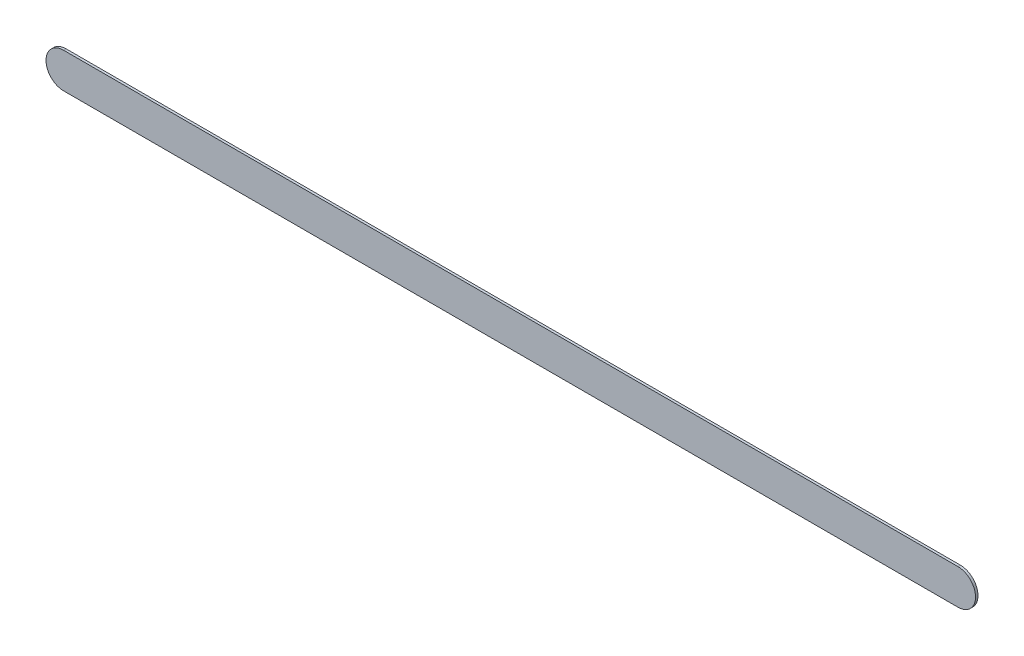
ISO-10303-21;
HEADER;
FILE_DESCRIPTION(('STEP AP214'),'2;1');
FILE_NAME('part.step','',(''),(''),'','','');
FILE_SCHEMA(('AUTOMOTIVE_DESIGN { 1 0 10303 214 1 1 1 1 }'));
ENDSEC;
DATA;
#1=APPLICATION_CONTEXT('core data for automotive mechanical design processes');
#2=APPLICATION_PROTOCOL_DEFINITION('international standard','automotive_design',2000,#1);
#3=PRODUCT_CONTEXT('',#1,'mechanical');
#4=PRODUCT('Part','Part','',(#3));
#5=PRODUCT_RELATED_PRODUCT_CATEGORY('part','',(#4));
#6=PRODUCT_DEFINITION_FORMATION('','',#4);
#7=PRODUCT_DEFINITION_CONTEXT('part definition',#1,'design');
#8=PRODUCT_DEFINITION('design','',#6,#7);
#9=PRODUCT_DEFINITION_SHAPE('','',#8);
#10=(LENGTH_UNIT() NAMED_UNIT(*) SI_UNIT(.MILLI.,.METRE.));
#11=(NAMED_UNIT(*) PLANE_ANGLE_UNIT() SI_UNIT($,.RADIAN.));
#12=(NAMED_UNIT(*) SI_UNIT($,.STERADIAN.) SOLID_ANGLE_UNIT());
#13=UNCERTAINTY_MEASURE_WITH_UNIT(LENGTH_MEASURE(1.E-05),#10,'distance_accuracy_value','');
#14=(GEOMETRIC_REPRESENTATION_CONTEXT(3) GLOBAL_UNCERTAINTY_ASSIGNED_CONTEXT((#13)) GLOBAL_UNIT_ASSIGNED_CONTEXT((#10,
#11,#12)) REPRESENTATION_CONTEXT('',''));
#15=CARTESIAN_POINT('',(0.,0.,0.));
#16=DIRECTION('',(0.,0.,1.));
#17=DIRECTION('',(1.,0.,0.));
#18=AXIS2_PLACEMENT_3D('',#15,#16,#17);
#19=CARTESIAN_POINT('',(160.528,-88.642,0.));
#20=DIRECTION('',(0.,0.,1.));
#21=DIRECTION('',(1.,0.,0.));
#22=AXIS2_PLACEMENT_3D('',#19,#20,#21);
#23=PLANE('',#22);
#24=DIRECTION('',(1.,0.,0.));
#25=VECTOR('',#24,1.);
#26=CARTESIAN_POINT('',(160.528,-88.642,0.));
#27=LINE('',#26,#25);
#28=CARTESIAN_POINT('',(160.528,-88.642,0.));
#29=VERTEX_POINT('',#28);
#30=CARTESIAN_POINT('',(173.228,-88.642,0.));
#31=VERTEX_POINT('',#30);
#32=EDGE_CURVE('E77',#29,#31,#27,.T.);
#33=ORIENTED_EDGE('',*,*,#32,.T.);
#34=CARTESIAN_POINT('',(173.228,-88.392,0.));
#35=DIRECTION('',(0.,0.,1.));
#36=DIRECTION('',(0.,-1.,0.));
#37=AXIS2_PLACEMENT_3D('',#34,#35,#36);
#38=CIRCLE('',#37,0.25);
#39=CARTESIAN_POINT('',(173.228,-88.142,0.));
#40=VERTEX_POINT('',#39);
#41=EDGE_CURVE('E75',#31,#40,#38,.T.);
#42=ORIENTED_EDGE('',*,*,#41,.T.);
#43=DIRECTION('',(-1.,0.,0.));
#44=VECTOR('',#43,1.);
#45=CARTESIAN_POINT('',(173.228,-88.142,0.));
#46=LINE('',#45,#44);
#47=CARTESIAN_POINT('',(160.528,-88.142,0.));
#48=VERTEX_POINT('',#47);
#49=EDGE_CURVE('E20',#40,#48,#46,.T.);
#50=ORIENTED_EDGE('',*,*,#49,.T.);
#51=CARTESIAN_POINT('',(160.528,-88.392,0.));
#52=DIRECTION('',(0.,0.,1.));
#53=DIRECTION('',(0.,1.,0.));
#54=AXIS2_PLACEMENT_3D('',#51,#52,#53);
#55=CIRCLE('',#54,0.25);
#56=EDGE_CURVE('E11',#48,#29,#55,.T.);
#57=ORIENTED_EDGE('',*,*,#56,.T.);
#58=EDGE_LOOP('',(#33,#42,#50,#57));
#59=FACE_BOUND('',#58,.T.);
#60=ADVANCED_FACE('F17',(#59),#23,.T.);
#61=CARTESIAN_POINT('',(160.528,-88.642,-0.035));
#62=DIRECTION('',(0.,0.,1.));
#63=DIRECTION('',(1.,0.,0.));
#64=AXIS2_PLACEMENT_3D('',#61,#62,#63);
#65=PLANE('',#64);
#66=CARTESIAN_POINT('',(160.528,-88.392,-0.035));
#67=DIRECTION('',(0.,0.,1.));
#68=DIRECTION('',(0.,1.,0.));
#69=AXIS2_PLACEMENT_3D('',#66,#67,#68);
#70=CIRCLE('',#69,0.25);
#71=CARTESIAN_POINT('',(160.528,-88.142,-0.035));
#72=VERTEX_POINT('',#71);
#73=CARTESIAN_POINT('',(160.528,-88.642,-0.035));
#74=VERTEX_POINT('',#73);
#75=EDGE_CURVE('E27',#72,#74,#70,.T.);
#76=ORIENTED_EDGE('',*,*,#75,.F.);
#77=DIRECTION('',(-1.,0.,0.));
#78=VECTOR('',#77,1.);
#79=CARTESIAN_POINT('',(173.228,-88.142,-0.035));
#80=LINE('',#79,#78);
#81=CARTESIAN_POINT('',(173.228,-88.142,-0.035));
#82=VERTEX_POINT('',#81);
#83=EDGE_CURVE('E82',#82,#72,#80,.T.);
#84=ORIENTED_EDGE('',*,*,#83,.F.);
#85=CARTESIAN_POINT('',(173.228,-88.392,-0.035));
#86=DIRECTION('',(0.,0.,1.));
#87=DIRECTION('',(0.,-1.,0.));
#88=AXIS2_PLACEMENT_3D('',#85,#86,#87);
#89=CIRCLE('',#88,0.25);
#90=CARTESIAN_POINT('',(173.228,-88.642,-0.035));
#91=VERTEX_POINT('',#90);
#92=EDGE_CURVE('E85',#91,#82,#89,.T.);
#93=ORIENTED_EDGE('',*,*,#92,.F.);
#94=DIRECTION('',(1.,0.,0.));
#95=VECTOR('',#94,1.);
#96=CARTESIAN_POINT('',(160.528,-88.642,-0.035));
#97=LINE('',#96,#95);
#98=EDGE_CURVE('E138',#74,#91,#97,.T.);
#99=ORIENTED_EDGE('',*,*,#98,.F.);
#100=EDGE_LOOP('',(#76,#84,#93,#99));
#101=FACE_BOUND('',#100,.T.);
#102=ADVANCED_FACE('F151',(#101),#65,.F.);
#103=CARTESIAN_POINT('',(160.528,-88.392,-0.035));
#104=DIRECTION('',(0.,0.,-1.));
#105=DIRECTION('',(0.,1.,0.));
#106=AXIS2_PLACEMENT_3D('',#103,#104,#105);
#107=CYLINDRICAL_SURFACE('',#106,0.25);
#108=ORIENTED_EDGE('',*,*,#75,.T.);
#109=DIRECTION('',(0.,0.,1.));
#110=VECTOR('',#109,1.);
#111=CARTESIAN_POINT('',(160.528,-88.642,-0.035));
#112=LINE('',#111,#110);
#113=EDGE_CURVE('E92',#74,#29,#112,.T.);
#114=ORIENTED_EDGE('',*,*,#113,.T.);
#115=ORIENTED_EDGE('',*,*,#56,.F.);
#116=DIRECTION('',(0.,0.,1.));
#117=VECTOR('',#116,1.);
#118=CARTESIAN_POINT('',(160.528,-88.142,-0.035));
#119=LINE('',#118,#117);
#120=EDGE_CURVE('E71',#72,#48,#119,.T.);
#121=ORIENTED_EDGE('',*,*,#120,.F.);
#122=EDGE_LOOP('',(#108,#114,#115,#121));
#123=FACE_BOUND('',#122,.T.);
#124=ADVANCED_FACE('F154',(#123),#107,.T.);
#125=CARTESIAN_POINT('',(173.228,-88.142,-0.035));
#126=DIRECTION('',(0.,-1.,0.));
#127=DIRECTION('',(0.,0.,-1.));
#128=AXIS2_PLACEMENT_3D('',#125,#126,#127);
#129=PLANE('',#128);
#130=ORIENTED_EDGE('',*,*,#83,.T.);
#131=ORIENTED_EDGE('',*,*,#120,.T.);
#132=ORIENTED_EDGE('',*,*,#49,.F.);
#133=DIRECTION('',(0.,0.,1.));
#134=VECTOR('',#133,1.);
#135=CARTESIAN_POINT('',(173.228,-88.142,-0.035));
#136=LINE('',#135,#134);
#137=EDGE_CURVE('E69',#82,#40,#136,.T.);
#138=ORIENTED_EDGE('',*,*,#137,.F.);
#139=EDGE_LOOP('',(#130,#131,#132,#138));
#140=FACE_BOUND('',#139,.T.);
#141=ADVANCED_FACE('F67',(#140),#129,.F.);
#142=CARTESIAN_POINT('',(173.228,-88.392,-0.035));
#143=DIRECTION('',(0.,0.,-1.));
#144=DIRECTION('',(0.,-1.,0.));
#145=AXIS2_PLACEMENT_3D('',#142,#143,#144);
#146=CYLINDRICAL_SURFACE('',#145,0.25);
#147=ORIENTED_EDGE('',*,*,#92,.T.);
#148=ORIENTED_EDGE('',*,*,#137,.T.);
#149=ORIENTED_EDGE('',*,*,#41,.F.);
#150=DIRECTION('',(0.,0.,1.));
#151=VECTOR('',#150,1.);
#152=CARTESIAN_POINT('',(173.228,-88.642,-0.035));
#153=LINE('',#152,#151);
#154=EDGE_CURVE('E132',#91,#31,#153,.T.);
#155=ORIENTED_EDGE('',*,*,#154,.F.);
#156=EDGE_LOOP('',(#147,#148,#149,#155));
#157=FACE_BOUND('',#156,.T.);
#158=ADVANCED_FACE('F84',(#157),#146,.T.);
#159=CARTESIAN_POINT('',(160.528,-88.642,-0.035));
#160=DIRECTION('',(0.,1.,0.));
#161=DIRECTION('',(1.,0.,0.));
#162=AXIS2_PLACEMENT_3D('',#159,#160,#161);
#163=PLANE('',#162);
#164=ORIENTED_EDGE('',*,*,#98,.T.);
#165=ORIENTED_EDGE('',*,*,#154,.T.);
#166=ORIENTED_EDGE('',*,*,#32,.F.);
#167=ORIENTED_EDGE('',*,*,#113,.F.);
#168=EDGE_LOOP('',(#164,#165,#166,#167));
#169=FACE_BOUND('',#168,.T.);
#170=ADVANCED_FACE('F149',(#169),#163,.F.);
#171=CLOSED_SHELL('',(#60,#102,#124,#141,#158,#170));
#172=MANIFOLD_SOLID_BREP('B1',#171);
#173=ADVANCED_BREP_SHAPE_REPRESENTATION('',(#18,#172),#14);
#174=SHAPE_DEFINITION_REPRESENTATION(#9,#173);
ENDSEC;
END-ISO-10303-21;
